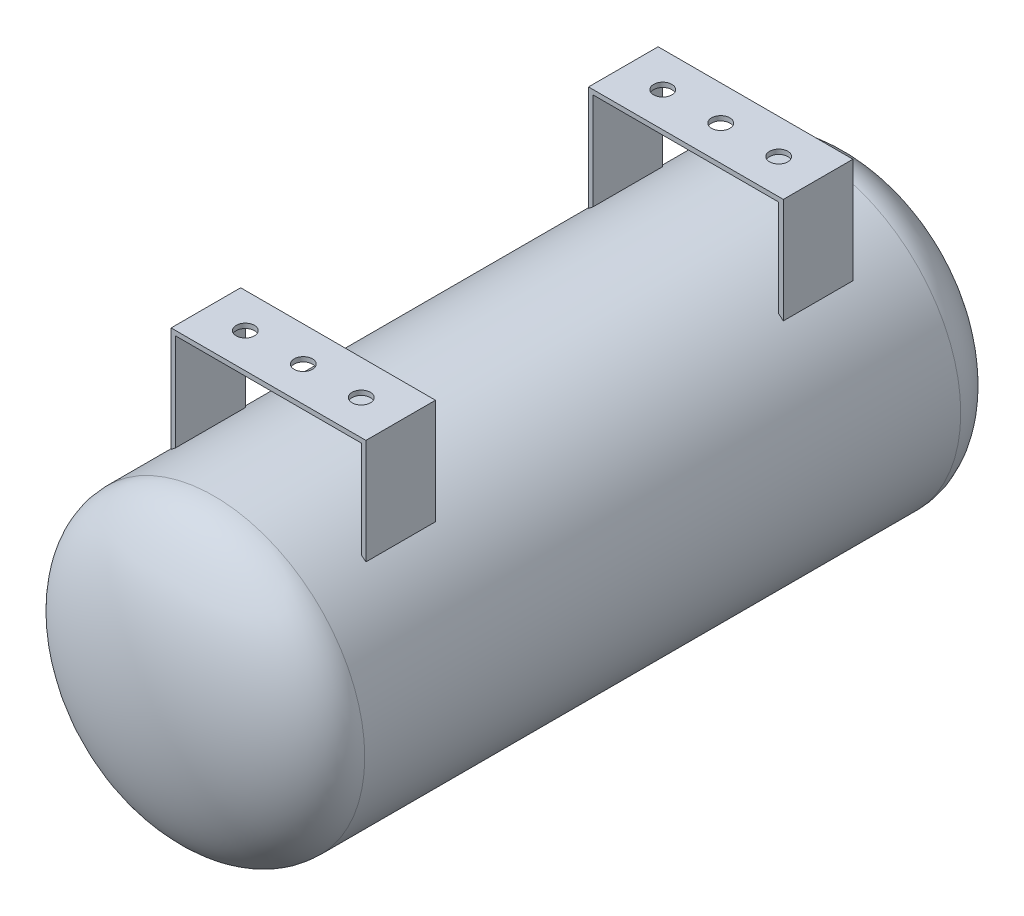
ISO-10303-21;
HEADER;
FILE_DESCRIPTION(('STEP AP214'),'2;1');
FILE_NAME('part.step','',(''),(''),'','','');
FILE_SCHEMA(('AUTOMOTIVE_DESIGN { 1 0 10303 214 1 1 1 1 }'));
ENDSEC;
DATA;
#1=APPLICATION_CONTEXT('core data for automotive mechanical design processes');
#2=APPLICATION_PROTOCOL_DEFINITION('international standard','automotive_design',2000,#1);
#3=PRODUCT_CONTEXT('',#1,'mechanical');
#4=PRODUCT('Part','Part','',(#3));
#5=PRODUCT_RELATED_PRODUCT_CATEGORY('part','',(#4));
#6=PRODUCT_DEFINITION_FORMATION('','',#4);
#7=PRODUCT_DEFINITION_CONTEXT('part definition',#1,'design');
#8=PRODUCT_DEFINITION('design','',#6,#7);
#9=PRODUCT_DEFINITION_SHAPE('','',#8);
#10=(LENGTH_UNIT() NAMED_UNIT(*) SI_UNIT(.MILLI.,.METRE.));
#11=(NAMED_UNIT(*) PLANE_ANGLE_UNIT() SI_UNIT($,.RADIAN.));
#12=(NAMED_UNIT(*) SI_UNIT($,.STERADIAN.) SOLID_ANGLE_UNIT());
#13=UNCERTAINTY_MEASURE_WITH_UNIT(LENGTH_MEASURE(1.E-05),#10,'distance_accuracy_value','');
#14=(GEOMETRIC_REPRESENTATION_CONTEXT(3) GLOBAL_UNCERTAINTY_ASSIGNED_CONTEXT((#13)) GLOBAL_UNIT_ASSIGNED_CONTEXT((#10,
#11,#12)) REPRESENTATION_CONTEXT('',''));
#15=CARTESIAN_POINT('',(0.,0.,0.));
#16=DIRECTION('',(0.,0.,1.));
#17=DIRECTION('',(1.,0.,0.));
#18=AXIS2_PLACEMENT_3D('',#15,#16,#17);
#19=CARTESIAN_POINT('',(50.8,-82.551,133.35));
#20=DIRECTION('',(-1.,0.,0.));
#21=DIRECTION('',(0.,0.,1.));
#22=AXIS2_PLACEMENT_3D('',#19,#20,#21);
#23=PLANE('',#22);
#24=DIRECTION('',(0.,1.,0.));
#25=VECTOR('',#24,1.);
#26=CARTESIAN_POINT('',(50.8,-82.551,133.35));
#27=LINE('',#26,#25);
#28=CARTESIAN_POINT('',(50.8,65.0681373638435,133.35));
#29=VERTEX_POINT('',#28);
#30=CARTESIAN_POINT('',(50.8,118.11,133.35));
#31=VERTEX_POINT('',#30);
#32=EDGE_CURVE('E221',#29,#31,#27,.T.);
#33=ORIENTED_EDGE('',*,*,#32,.T.);
#34=DIRECTION('',(0.,0.,-1.));
#35=VECTOR('',#34,1.);
#36=CARTESIAN_POINT('',(50.8,118.11,133.35));
#37=LINE('',#36,#35);
#38=CARTESIAN_POINT('',(50.8,118.11,95.25));
#39=VERTEX_POINT('',#38);
#40=EDGE_CURVE('E207',#31,#39,#37,.T.);
#41=ORIENTED_EDGE('',*,*,#40,.T.);
#42=DIRECTION('',(0.,1.,0.));
#43=VECTOR('',#42,1.);
#44=CARTESIAN_POINT('',(50.8,-82.551,95.25));
#45=LINE('',#44,#43);
#46=CARTESIAN_POINT('',(50.8,65.0681373638435,95.25));
#47=VERTEX_POINT('',#46);
#48=EDGE_CURVE('E225',#47,#39,#45,.T.);
#49=ORIENTED_EDGE('',*,*,#48,.F.);
#50=DIRECTION('',(0.,0.,1.));
#51=VECTOR('',#50,1.);
#52=CARTESIAN_POINT('',(50.8,65.0681373638435,0.));
#53=LINE('',#52,#51);
#54=EDGE_CURVE('E218',#47,#29,#53,.T.);
#55=ORIENTED_EDGE('',*,*,#54,.T.);
#56=EDGE_LOOP('',(#33,#41,#49,#55));
#57=FACE_BOUND('',#56,.T.);
#58=ADVANCED_FACE('F38',(#57),#23,.T.);
#59=CARTESIAN_POINT('',(-50.8,-82.551,-133.35));
#60=DIRECTION('',(1.,0.,0.));
#61=DIRECTION('',(0.,0.,-1.));
#62=AXIS2_PLACEMENT_3D('',#59,#60,#61);
#63=PLANE('',#62);
#64=DIRECTION('',(0.,1.,0.));
#65=VECTOR('',#64,1.);
#66=CARTESIAN_POINT('',(-50.8,-82.551,-133.35));
#67=LINE('',#66,#65);
#68=CARTESIAN_POINT('',(-50.8,65.0681373638435,-133.35));
#69=VERTEX_POINT('',#68);
#70=CARTESIAN_POINT('',(-50.8,118.11,-133.35));
#71=VERTEX_POINT('',#70);
#72=EDGE_CURVE('E313',#69,#71,#67,.T.);
#73=ORIENTED_EDGE('',*,*,#72,.T.);
#74=DIRECTION('',(0.,0.,1.));
#75=VECTOR('',#74,1.);
#76=CARTESIAN_POINT('',(-50.8,118.11,-133.35));
#77=LINE('',#76,#75);
#78=CARTESIAN_POINT('',(-50.8,118.11,-95.25));
#79=VERTEX_POINT('',#78);
#80=EDGE_CURVE('E288',#71,#79,#77,.T.);
#81=ORIENTED_EDGE('',*,*,#80,.T.);
#82=DIRECTION('',(0.,1.,0.));
#83=VECTOR('',#82,1.);
#84=CARTESIAN_POINT('',(-50.8,-82.551,-95.25));
#85=LINE('',#84,#83);
#86=CARTESIAN_POINT('',(-50.8,65.0681373638435,-95.25));
#87=VERTEX_POINT('',#86);
#88=EDGE_CURVE('E316',#87,#79,#85,.T.);
#89=ORIENTED_EDGE('',*,*,#88,.F.);
#90=DIRECTION('',(0.,0.,1.));
#91=VECTOR('',#90,1.);
#92=CARTESIAN_POINT('',(-50.8,65.0681373638435,0.));
#93=LINE('',#92,#91);
#94=EDGE_CURVE('E294',#87,#69,#93,.F.);
#95=ORIENTED_EDGE('',*,*,#94,.T.);
#96=EDGE_LOOP('',(#73,#81,#89,#95));
#97=FACE_BOUND('',#96,.T.);
#98=ADVANCED_FACE('F338',(#97),#63,.T.);
#99=CARTESIAN_POINT('',(0.,0.,163.195));
#100=DIRECTION('',(0.,1.,0.));
#101=DIRECTION('',(-1.,0.,0.));
#102=AXIS2_PLACEMENT_3D('',#99,#100,#101);
#103=ELLIPSE('',#102,82.55,40.64);
#104=TRIMMED_CURVE('',#103,(PARAMETER_VALUE(-1.5707963267949)),
(PARAMETER_VALUE(1.5707963267949)),.T.,.PARAMETER.);
#105=CARTESIAN_POINT('',(0.,0.,0.));
#106=DIRECTION('',(0.,0.,1.));
#107=AXIS1_PLACEMENT('',#105,#106);
#108=SURFACE_OF_REVOLUTION('',#104,#107);
#109=CARTESIAN_POINT('',(0.,0.,203.835));
#110=VERTEX_POINT('',#109);
#111=VERTEX_LOOP('',#110);
#112=FACE_BOUND('',#111,.T.);
#113=CARTESIAN_POINT('',(0.,0.,163.195));
#114=DIRECTION('',(0.,0.,1.));
#115=DIRECTION('',(1.,0.,0.));
#116=AXIS2_PLACEMENT_3D('',#113,#114,#115);
#117=CIRCLE('',#116,82.55);
#118=CARTESIAN_POINT('',(82.55,0.,163.195));
#119=VERTEX_POINT('',#118);
#120=EDGE_CURVE('E406',#119,#119,#117,.T.);
#121=ORIENTED_EDGE('',*,*,#120,.T.);
#122=EDGE_LOOP('',(#121));
#123=FACE_BOUND('',#122,.T.);
#124=ADVANCED_FACE('F40',(#112,#123),#108,.T.);
#125=CARTESIAN_POINT('',(0.,0.,0.));
#126=DIRECTION('',(0.,0.,1.));
#127=DIRECTION('',(1.,0.,0.));
#128=AXIS2_PLACEMENT_3D('',#125,#126,#127);
#129=CYLINDRICAL_SURFACE('',#128,82.55);
#130=DIRECTION('',(0.,0.,1.));
#131=VECTOR('',#130,1.);
#132=CARTESIAN_POINT('',(-50.8,65.0681373638435,0.));
#133=LINE('',#132,#131);
#134=CARTESIAN_POINT('',(-50.8,65.0681373638435,133.35));
#135=VERTEX_POINT('',#134);
#136=CARTESIAN_POINT('',(-50.8,65.0681373638435,95.25));
#137=VERTEX_POINT('',#136);
#138=EDGE_CURVE('E163',#135,#137,#133,.F.);
#139=ORIENTED_EDGE('',*,*,#138,.F.);
#140=CARTESIAN_POINT('',(0.,0.,133.35));
#141=DIRECTION('',(0.,0.,1.));
#142=DIRECTION('',(1.,0.,0.));
#143=AXIS2_PLACEMENT_3D('',#140,#141,#142);
#144=CIRCLE('',#143,82.55);
#145=CARTESIAN_POINT('',(-53.34,63.0027531144473,133.35));
#146=VERTEX_POINT('',#145);
#147=EDGE_CURVE('E178',#146,#135,#144,.F.);
#148=ORIENTED_EDGE('',*,*,#147,.F.);
#149=DIRECTION('',(0.,0.,1.));
#150=VECTOR('',#149,1.);
#151=CARTESIAN_POINT('',(-53.34,63.0027531144473,0.));
#152=LINE('',#151,#150);
#153=CARTESIAN_POINT('',(-53.34,63.0027531144473,95.25));
#154=VERTEX_POINT('',#153);
#155=EDGE_CURVE('E173',#154,#146,#152,.T.);
#156=ORIENTED_EDGE('',*,*,#155,.F.);
#157=CARTESIAN_POINT('',(0.,0.,95.25));
#158=DIRECTION('',(0.,0.,-1.));
#159=DIRECTION('',(-1.,0.,0.));
#160=AXIS2_PLACEMENT_3D('',#157,#158,#159);
#161=CIRCLE('',#160,82.55);
#162=EDGE_CURVE('E159',#137,#154,#161,.F.);
#163=ORIENTED_EDGE('',*,*,#162,.F.);
#164=EDGE_LOOP('',(#139,#148,#156,#163));
#165=FACE_BOUND('',#164,.T.);
#166=DIRECTION('',(0.,0.,1.));
#167=VECTOR('',#166,1.);
#168=CARTESIAN_POINT('',(53.34,63.0027531144473,0.));
#169=LINE('',#168,#167);
#170=CARTESIAN_POINT('',(53.34,63.0027531144473,133.35));
#171=VERTEX_POINT('',#170);
#172=CARTESIAN_POINT('',(53.34,63.0027531144473,95.25));
#173=VERTEX_POINT('',#172);
#174=EDGE_CURVE('E230',#171,#173,#169,.F.);
#175=ORIENTED_EDGE('',*,*,#174,.F.);
#176=CARTESIAN_POINT('',(0.,0.,133.35));
#177=DIRECTION('',(0.,0.,1.));
#178=DIRECTION('',(1.,0.,0.));
#179=AXIS2_PLACEMENT_3D('',#176,#177,#178);
#180=CIRCLE('',#179,82.55);
#181=EDGE_CURVE('E213',#29,#171,#180,.F.);
#182=ORIENTED_EDGE('',*,*,#181,.F.);
#183=ORIENTED_EDGE('',*,*,#54,.F.);
#184=CARTESIAN_POINT('',(0.,0.,95.25));
#185=DIRECTION('',(0.,0.,-1.));
#186=DIRECTION('',(-1.,0.,0.));
#187=AXIS2_PLACEMENT_3D('',#184,#185,#186);
#188=CIRCLE('',#187,82.55);
#189=EDGE_CURVE('E222',#173,#47,#188,.F.);
#190=ORIENTED_EDGE('',*,*,#189,.F.);
#191=EDGE_LOOP('',(#175,#182,#183,#190));
#192=FACE_BOUND('',#191,.T.);
#193=DIRECTION('',(0.,0.,1.));
#194=VECTOR('',#193,1.);
#195=CARTESIAN_POINT('',(50.8,65.0681373638435,0.));
#196=LINE('',#195,#194);
#197=CARTESIAN_POINT('',(50.8,65.0681373638435,-133.35));
#198=VERTEX_POINT('',#197);
#199=CARTESIAN_POINT('',(50.8,65.0681373638435,-95.25));
#200=VERTEX_POINT('',#199);
#201=EDGE_CURVE('E246',#198,#200,#196,.T.);
#202=ORIENTED_EDGE('',*,*,#201,.F.);
#203=CARTESIAN_POINT('',(0.,0.,-133.35));
#204=DIRECTION('',(0.,0.,-1.));
#205=DIRECTION('',(-1.,0.,0.));
#206=AXIS2_PLACEMENT_3D('',#203,#204,#205);
#207=CIRCLE('',#206,82.55);
#208=CARTESIAN_POINT('',(53.34,63.0027531144473,-133.35));
#209=VERTEX_POINT('',#208);
#210=EDGE_CURVE('E242',#209,#198,#207,.F.);
#211=ORIENTED_EDGE('',*,*,#210,.F.);
#212=DIRECTION('',(0.,0.,1.));
#213=VECTOR('',#212,1.);
#214=CARTESIAN_POINT('',(53.34,63.0027531144473,0.));
#215=LINE('',#214,#213);
#216=CARTESIAN_POINT('',(53.34,63.0027531144473,-95.25));
#217=VERTEX_POINT('',#216);
#218=EDGE_CURVE('E216',#217,#209,#215,.F.);
#219=ORIENTED_EDGE('',*,*,#218,.F.);
#220=CARTESIAN_POINT('',(0.,0.,-95.25));
#221=DIRECTION('',(0.,0.,1.));
#222=DIRECTION('',(1.,0.,0.));
#223=AXIS2_PLACEMENT_3D('',#220,#221,#222);
#224=CIRCLE('',#223,82.55);
#225=EDGE_CURVE('E254',#200,#217,#224,.F.);
#226=ORIENTED_EDGE('',*,*,#225,.F.);
#227=EDGE_LOOP('',(#202,#211,#219,#226));
#228=FACE_BOUND('',#227,.T.);
#229=ORIENTED_EDGE('',*,*,#94,.F.);
#230=CARTESIAN_POINT('',(0.,0.,-95.25));
#231=DIRECTION('',(0.,0.,1.));
#232=DIRECTION('',(1.,0.,0.));
#233=AXIS2_PLACEMENT_3D('',#230,#231,#232);
#234=CIRCLE('',#233,82.55);
#235=CARTESIAN_POINT('',(-53.34,63.0027531144473,-95.25));
#236=VERTEX_POINT('',#235);
#237=EDGE_CURVE('E298',#236,#87,#234,.F.);
#238=ORIENTED_EDGE('',*,*,#237,.F.);
#239=DIRECTION('',(0.,0.,1.));
#240=VECTOR('',#239,1.);
#241=CARTESIAN_POINT('',(-53.34,63.0027531144473,0.));
#242=LINE('',#241,#240);
#243=CARTESIAN_POINT('',(-53.34,63.0027531144473,-133.35));
#244=VERTEX_POINT('',#243);
#245=EDGE_CURVE('E300',#244,#236,#242,.T.);
#246=ORIENTED_EDGE('',*,*,#245,.F.);
#247=CARTESIAN_POINT('',(0.,0.,-133.35));
#248=DIRECTION('',(0.,0.,-1.));
#249=DIRECTION('',(-1.,0.,0.));
#250=AXIS2_PLACEMENT_3D('',#247,#248,#249);
#251=CIRCLE('',#250,82.55);
#252=EDGE_CURVE('E297',#69,#244,#251,.F.);
#253=ORIENTED_EDGE('',*,*,#252,.F.);
#254=EDGE_LOOP('',(#229,#238,#246,#253));
#255=FACE_BOUND('',#254,.T.);
#256=ORIENTED_EDGE('',*,*,#120,.F.);
#257=EDGE_LOOP('',(#256));
#258=FACE_BOUND('',#257,.T.);
#259=CARTESIAN_POINT('',(0.,0.,-163.195));
#260=DIRECTION('',(0.,0.,1.));
#261=DIRECTION('',(1.,0.,0.));
#262=AXIS2_PLACEMENT_3D('',#259,#260,#261);
#263=CIRCLE('',#262,82.55);
#264=CARTESIAN_POINT('',(82.55,0.,-163.195));
#265=VERTEX_POINT('',#264);
#266=EDGE_CURVE('E302',#265,#265,#263,.T.);
#267=ORIENTED_EDGE('',*,*,#266,.T.);
#268=EDGE_LOOP('',(#267));
#269=FACE_BOUND('',#268,.T.);
#270=ADVANCED_FACE('F170',(#165,#192,#228,#255,#258,#269),#129,.T.);
#271=CARTESIAN_POINT('',(0.,0.,-163.195));
#272=DIRECTION('',(0.,1.,0.));
#273=DIRECTION('',(-1.,0.,0.));
#274=AXIS2_PLACEMENT_3D('',#271,#272,#273);
#275=ELLIPSE('',#274,82.55,40.64);
#276=TRIMMED_CURVE('',#275,(PARAMETER_VALUE(4.71238898038469)),
(PARAMETER_VALUE(7.85398163397448)),.T.,.PARAMETER.);
#277=CARTESIAN_POINT('',(0.,0.,0.));
#278=DIRECTION('',(0.,0.,1.));
#279=AXIS1_PLACEMENT('',#277,#278);
#280=SURFACE_OF_REVOLUTION('',#276,#279);
#281=ORIENTED_EDGE('',*,*,#266,.F.);
#282=EDGE_LOOP('',(#281));
#283=FACE_BOUND('',#282,.T.);
#284=CARTESIAN_POINT('',(0.,0.,-203.835));
#285=VERTEX_POINT('',#284);
#286=VERTEX_LOOP('',#285);
#287=FACE_BOUND('',#286,.T.);
#288=ADVANCED_FACE('F327',(#283,#287),#280,.T.);
#289=CARTESIAN_POINT('',(0.,120.65,0.));
#290=DIRECTION('',(0.,1.,0.));
#291=DIRECTION('',(0.,0.,1.));
#292=AXIS2_PLACEMENT_3D('',#289,#290,#291);
#293=PLANE('',#292);
#294=DIRECTION('',(1.,0.,0.));
#295=VECTOR('',#294,1.);
#296=CARTESIAN_POINT('',(-53.34,120.65,-95.25));
#297=LINE('',#296,#295);
#298=CARTESIAN_POINT('',(-53.34,120.65,-95.25));
#299=VERTEX_POINT('',#298);
#300=CARTESIAN_POINT('',(53.34,120.65,-95.25));
#301=VERTEX_POINT('',#300);
#302=EDGE_CURVE('E305',#299,#301,#297,.T.);
#303=ORIENTED_EDGE('',*,*,#302,.T.);
#304=DIRECTION('',(0.,0.,-1.));
#305=VECTOR('',#304,1.);
#306=CARTESIAN_POINT('',(53.34,120.65,-133.35));
#307=LINE('',#306,#305);
#308=CARTESIAN_POINT('',(53.34,120.65,-133.35));
#309=VERTEX_POINT('',#308);
#310=EDGE_CURVE('E274',#301,#309,#307,.T.);
#311=ORIENTED_EDGE('',*,*,#310,.T.);
#312=DIRECTION('',(-1.,0.,0.));
#313=VECTOR('',#312,1.);
#314=CARTESIAN_POINT('',(-53.34,120.65,-133.35));
#315=LINE('',#314,#313);
#316=CARTESIAN_POINT('',(-53.34,120.65,-133.35));
#317=VERTEX_POINT('',#316);
#318=EDGE_CURVE('E307',#309,#317,#315,.T.);
#319=ORIENTED_EDGE('',*,*,#318,.T.);
#320=DIRECTION('',(0.,0.,1.));
#321=VECTOR('',#320,1.);
#322=CARTESIAN_POINT('',(-53.34,120.65,-133.35));
#323=LINE('',#322,#321);
#324=EDGE_CURVE('E293',#317,#299,#323,.T.);
#325=ORIENTED_EDGE('',*,*,#324,.T.);
#326=EDGE_LOOP('',(#303,#311,#319,#325));
#327=FACE_BOUND('',#326,.T.);
#328=CARTESIAN_POINT('',(31.75,120.65,-114.3));
#329=DIRECTION('',(0.,1.,0.));
#330=DIRECTION('',(0.,0.,1.));
#331=AXIS2_PLACEMENT_3D('',#328,#329,#330);
#332=CIRCLE('',#331,5.0000000000054);
#333=CARTESIAN_POINT('',(31.75,120.65,-109.299999999995));
#334=VERTEX_POINT('',#333);
#335=EDGE_CURVE('E250',#334,#334,#332,.T.);
#336=ORIENTED_EDGE('',*,*,#335,.F.);
#337=EDGE_LOOP('',(#336));
#338=FACE_BOUND('',#337,.T.);
#339=CARTESIAN_POINT('',(0.,120.65,-114.3));
#340=DIRECTION('',(0.,1.,0.));
#341=DIRECTION('',(0.,0.,1.));
#342=AXIS2_PLACEMENT_3D('',#339,#340,#341);
#343=CIRCLE('',#342,5.00000000000539);
#344=CARTESIAN_POINT('',(0.,120.65,-109.299999999995));
#345=VERTEX_POINT('',#344);
#346=EDGE_CURVE('E262',#345,#345,#343,.T.);
#347=ORIENTED_EDGE('',*,*,#346,.F.);
#348=EDGE_LOOP('',(#347));
#349=FACE_BOUND('',#348,.T.);
#350=CARTESIAN_POINT('',(-31.75,120.65,-114.3));
#351=DIRECTION('',(0.,1.,0.));
#352=DIRECTION('',(0.,0.,1.));
#353=AXIS2_PLACEMENT_3D('',#350,#351,#352);
#354=CIRCLE('',#353,5.);
#355=CARTESIAN_POINT('',(-31.75,120.65,-109.3));
#356=VERTEX_POINT('',#355);
#357=EDGE_CURVE('E268',#356,#356,#354,.T.);
#358=ORIENTED_EDGE('',*,*,#357,.F.);
#359=EDGE_LOOP('',(#358));
#360=FACE_BOUND('',#359,.T.);
#361=ADVANCED_FACE('F330',(#327,#338,#349,#360),#293,.T.);
#362=CARTESIAN_POINT('',(-53.34,-82.551,-95.25));
#363=DIRECTION('',(0.,0.,1.));
#364=DIRECTION('',(1.,0.,0.));
#365=AXIS2_PLACEMENT_3D('',#362,#363,#364);
#366=PLANE('',#365);
#367=DIRECTION('',(1.,0.,0.));
#368=VECTOR('',#367,1.);
#369=CARTESIAN_POINT('',(-53.34,118.11,-95.25));
#370=LINE('',#369,#368);
#371=CARTESIAN_POINT('',(50.8,118.11,-95.25));
#372=VERTEX_POINT('',#371);
#373=EDGE_CURVE('E277',#79,#372,#370,.T.);
#374=ORIENTED_EDGE('',*,*,#373,.T.);
#375=DIRECTION('',(0.,1.,0.));
#376=VECTOR('',#375,1.);
#377=CARTESIAN_POINT('',(50.8,-82.551,-95.25));
#378=LINE('',#377,#376);
#379=EDGE_CURVE('E245',#200,#372,#378,.T.);
#380=ORIENTED_EDGE('',*,*,#379,.F.);
#381=ORIENTED_EDGE('',*,*,#225,.T.);
#382=DIRECTION('',(0.,1.,0.));
#383=VECTOR('',#382,1.);
#384=CARTESIAN_POINT('',(53.34,118.11,-95.25));
#385=LINE('',#384,#383);
#386=EDGE_CURVE('E282',#217,#301,#385,.T.);
#387=ORIENTED_EDGE('',*,*,#386,.T.);
#388=ORIENTED_EDGE('',*,*,#302,.F.);
#389=DIRECTION('',(0.,1.,0.));
#390=VECTOR('',#389,1.);
#391=CARTESIAN_POINT('',(-53.34,-82.551,-95.25));
#392=LINE('',#391,#390);
#393=EDGE_CURVE('E309',#236,#299,#392,.T.);
#394=ORIENTED_EDGE('',*,*,#393,.F.);
#395=ORIENTED_EDGE('',*,*,#237,.T.);
#396=ORIENTED_EDGE('',*,*,#88,.T.);
#397=EDGE_LOOP('',(#374,#380,#381,#387,#388,#394,#395,#396));
#398=FACE_BOUND('',#397,.T.);
#399=ADVANCED_FACE('F387',(#398),#366,.T.);
#400=CARTESIAN_POINT('',(-53.34,-82.551,-133.35));
#401=DIRECTION('',(0.,0.,-1.));
#402=DIRECTION('',(-1.,0.,0.));
#403=AXIS2_PLACEMENT_3D('',#400,#401,#402);
#404=PLANE('',#403);
#405=DIRECTION('',(0.,1.,0.));
#406=VECTOR('',#405,1.);
#407=CARTESIAN_POINT('',(-53.34,-82.551,-133.35));
#408=LINE('',#407,#406);
#409=EDGE_CURVE('E310',#244,#317,#408,.T.);
#410=ORIENTED_EDGE('',*,*,#409,.T.);
#411=ORIENTED_EDGE('',*,*,#318,.F.);
#412=DIRECTION('',(0.,1.,0.));
#413=VECTOR('',#412,1.);
#414=CARTESIAN_POINT('',(53.34,118.11,-133.35));
#415=LINE('',#414,#413);
#416=EDGE_CURVE('E285',#209,#309,#415,.T.);
#417=ORIENTED_EDGE('',*,*,#416,.F.);
#418=ORIENTED_EDGE('',*,*,#210,.T.);
#419=DIRECTION('',(0.,1.,0.));
#420=VECTOR('',#419,1.);
#421=CARTESIAN_POINT('',(50.8,-82.551,-133.35));
#422=LINE('',#421,#420);
#423=CARTESIAN_POINT('',(50.8,118.11,-133.35));
#424=VERTEX_POINT('',#423);
#425=EDGE_CURVE('E247',#198,#424,#422,.T.);
#426=ORIENTED_EDGE('',*,*,#425,.T.);
#427=DIRECTION('',(-1.,0.,0.));
#428=VECTOR('',#427,1.);
#429=CARTESIAN_POINT('',(-53.34,118.11,-133.35));
#430=LINE('',#429,#428);
#431=EDGE_CURVE('E280',#424,#71,#430,.T.);
#432=ORIENTED_EDGE('',*,*,#431,.T.);
#433=ORIENTED_EDGE('',*,*,#72,.F.);
#434=ORIENTED_EDGE('',*,*,#252,.T.);
#435=EDGE_LOOP('',(#410,#411,#417,#418,#426,#432,#433,#434));
#436=FACE_BOUND('',#435,.T.);
#437=ADVANCED_FACE('F389',(#436),#404,.T.);
#438=CARTESIAN_POINT('',(-53.34,-82.551,-133.35));
#439=DIRECTION('',(-1.,0.,0.));
#440=DIRECTION('',(0.,0.,1.));
#441=AXIS2_PLACEMENT_3D('',#438,#439,#440);
#442=PLANE('',#441);
#443=ORIENTED_EDGE('',*,*,#324,.F.);
#444=ORIENTED_EDGE('',*,*,#409,.F.);
#445=ORIENTED_EDGE('',*,*,#245,.T.);
#446=ORIENTED_EDGE('',*,*,#393,.T.);
#447=EDGE_LOOP('',(#443,#444,#445,#446));
#448=FACE_BOUND('',#447,.T.);
#449=ADVANCED_FACE('F332',(#448),#442,.T.);
#450=CARTESIAN_POINT('',(53.34,118.11,-133.35));
#451=DIRECTION('',(1.,0.,0.));
#452=DIRECTION('',(0.,0.,-1.));
#453=AXIS2_PLACEMENT_3D('',#450,#451,#452);
#454=PLANE('',#453);
#455=ORIENTED_EDGE('',*,*,#310,.F.);
#456=ORIENTED_EDGE('',*,*,#386,.F.);
#457=ORIENTED_EDGE('',*,*,#218,.T.);
#458=ORIENTED_EDGE('',*,*,#416,.T.);
#459=EDGE_LOOP('',(#455,#456,#457,#458));
#460=FACE_BOUND('',#459,.T.);
#461=ADVANCED_FACE('F380',(#460),#454,.T.);
#462=CARTESIAN_POINT('',(0.,118.11,0.));
#463=DIRECTION('',(0.,1.,0.));
#464=DIRECTION('',(0.,0.,1.));
#465=AXIS2_PLACEMENT_3D('',#462,#463,#464);
#466=PLANE('',#465);
#467=ORIENTED_EDGE('',*,*,#431,.F.);
#468=DIRECTION('',(0.,0.,1.));
#469=VECTOR('',#468,1.);
#470=CARTESIAN_POINT('',(50.8,118.11,0.));
#471=LINE('',#470,#469);
#472=EDGE_CURVE('E47',#424,#372,#471,.T.);
#473=ORIENTED_EDGE('',*,*,#472,.T.);
#474=ORIENTED_EDGE('',*,*,#373,.F.);
#475=ORIENTED_EDGE('',*,*,#80,.F.);
#476=EDGE_LOOP('',(#467,#473,#474,#475));
#477=FACE_BOUND('',#476,.T.);
#478=CARTESIAN_POINT('',(31.75,118.11,-114.3));
#479=DIRECTION('',(0.,1.,0.));
#480=DIRECTION('',(0.,0.,1.));
#481=AXIS2_PLACEMENT_3D('',#478,#479,#480);
#482=CIRCLE('',#481,5.0000000000054);
#483=CARTESIAN_POINT('',(31.75,118.11,-109.299999999995));
#484=VERTEX_POINT('',#483);
#485=EDGE_CURVE('E259',#484,#484,#482,.T.);
#486=ORIENTED_EDGE('',*,*,#485,.T.);
#487=EDGE_LOOP('',(#486));
#488=FACE_BOUND('',#487,.T.);
#489=CARTESIAN_POINT('',(0.,118.11,-114.3));
#490=DIRECTION('',(0.,1.,0.));
#491=DIRECTION('',(0.,0.,1.));
#492=AXIS2_PLACEMENT_3D('',#489,#490,#491);
#493=CIRCLE('',#492,5.00000000000539);
#494=CARTESIAN_POINT('',(0.,118.11,-109.299999999995));
#495=VERTEX_POINT('',#494);
#496=EDGE_CURVE('E265',#495,#495,#493,.T.);
#497=ORIENTED_EDGE('',*,*,#496,.T.);
#498=EDGE_LOOP('',(#497));
#499=FACE_BOUND('',#498,.T.);
#500=CARTESIAN_POINT('',(-31.75,118.11,-114.3));
#501=DIRECTION('',(0.,1.,0.));
#502=DIRECTION('',(0.,0.,1.));
#503=AXIS2_PLACEMENT_3D('',#500,#501,#502);
#504=CIRCLE('',#503,5.);
#505=CARTESIAN_POINT('',(-31.75,118.11,-109.3));
#506=VERTEX_POINT('',#505);
#507=EDGE_CURVE('E271',#506,#506,#504,.T.);
#508=ORIENTED_EDGE('',*,*,#507,.T.);
#509=EDGE_LOOP('',(#508));
#510=FACE_BOUND('',#509,.T.);
#511=ADVANCED_FACE('F376',(#477,#488,#499,#510),#466,.F.);
#512=CARTESIAN_POINT('',(-31.75,118.11,-114.3));
#513=DIRECTION('',(0.,1.,0.));
#514=DIRECTION('',(0.,0.,1.));
#515=AXIS2_PLACEMENT_3D('',#512,#513,#514);
#516=CYLINDRICAL_SURFACE('',#515,5.);
#517=ORIENTED_EDGE('',*,*,#507,.F.);
#518=EDGE_LOOP('',(#517));
#519=FACE_BOUND('',#518,.T.);
#520=ORIENTED_EDGE('',*,*,#357,.T.);
#521=EDGE_LOOP('',(#520));
#522=FACE_BOUND('',#521,.T.);
#523=ADVANCED_FACE('F372',(#519,#522),#516,.F.);
#524=CARTESIAN_POINT('',(0.,118.11,-114.3));
#525=DIRECTION('',(0.,1.,0.));
#526=DIRECTION('',(0.,0.,1.));
#527=AXIS2_PLACEMENT_3D('',#524,#525,#526);
#528=CYLINDRICAL_SURFACE('',#527,5.00000000000539);
#529=ORIENTED_EDGE('',*,*,#496,.F.);
#530=EDGE_LOOP('',(#529));
#531=FACE_BOUND('',#530,.T.);
#532=ORIENTED_EDGE('',*,*,#346,.T.);
#533=EDGE_LOOP('',(#532));
#534=FACE_BOUND('',#533,.T.);
#535=ADVANCED_FACE('F368',(#531,#534),#528,.F.);
#536=CARTESIAN_POINT('',(31.75,118.11,-114.3));
#537=DIRECTION('',(0.,1.,0.));
#538=DIRECTION('',(0.,0.,1.));
#539=AXIS2_PLACEMENT_3D('',#536,#537,#538);
#540=CYLINDRICAL_SURFACE('',#539,5.0000000000054);
#541=ORIENTED_EDGE('',*,*,#485,.F.);
#542=EDGE_LOOP('',(#541));
#543=FACE_BOUND('',#542,.T.);
#544=ORIENTED_EDGE('',*,*,#335,.T.);
#545=EDGE_LOOP('',(#544));
#546=FACE_BOUND('',#545,.T.);
#547=ADVANCED_FACE('F364',(#543,#546),#540,.F.);
#548=CARTESIAN_POINT('',(50.8,-82.551,-133.35));
#549=DIRECTION('',(-1.,0.,0.));
#550=DIRECTION('',(0.,0.,1.));
#551=AXIS2_PLACEMENT_3D('',#548,#549,#550);
#552=PLANE('',#551);
#553=ORIENTED_EDGE('',*,*,#472,.F.);
#554=ORIENTED_EDGE('',*,*,#425,.F.);
#555=ORIENTED_EDGE('',*,*,#201,.T.);
#556=ORIENTED_EDGE('',*,*,#379,.T.);
#557=EDGE_LOOP('',(#553,#554,#555,#556));
#558=FACE_BOUND('',#557,.T.);
#559=ADVANCED_FACE('F354',(#558),#552,.T.);
#560=CARTESIAN_POINT('',(53.34,-82.551,133.35));
#561=DIRECTION('',(0.,0.,1.));
#562=DIRECTION('',(1.,0.,0.));
#563=AXIS2_PLACEMENT_3D('',#560,#561,#562);
#564=PLANE('',#563);
#565=DIRECTION('',(0.,1.,0.));
#566=VECTOR('',#565,1.);
#567=CARTESIAN_POINT('',(53.34,-82.551,133.35));
#568=LINE('',#567,#566);
#569=CARTESIAN_POINT('',(53.34,120.65,133.35));
#570=VERTEX_POINT('',#569);
#571=EDGE_CURVE('E217',#171,#570,#568,.T.);
#572=ORIENTED_EDGE('',*,*,#571,.T.);
#573=DIRECTION('',(1.,0.,0.));
#574=VECTOR('',#573,1.);
#575=CARTESIAN_POINT('',(53.34,120.65,133.35));
#576=LINE('',#575,#574);
#577=CARTESIAN_POINT('',(-53.34,120.65,133.35));
#578=VERTEX_POINT('',#577);
#579=EDGE_CURVE('E231',#578,#570,#576,.T.);
#580=ORIENTED_EDGE('',*,*,#579,.F.);
#581=DIRECTION('',(0.,1.,0.));
#582=VECTOR('',#581,1.);
#583=CARTESIAN_POINT('',(-53.34,118.11,133.35));
#584=LINE('',#583,#582);
#585=EDGE_CURVE('E182',#146,#578,#584,.T.);
#586=ORIENTED_EDGE('',*,*,#585,.F.);
#587=ORIENTED_EDGE('',*,*,#147,.T.);
#588=DIRECTION('',(0.,1.,0.));
#589=VECTOR('',#588,1.);
#590=CARTESIAN_POINT('',(-50.8,-82.551,133.35));
#591=LINE('',#590,#589);
#592=CARTESIAN_POINT('',(-50.8,118.11,133.35));
#593=VERTEX_POINT('',#592);
#594=EDGE_CURVE('E54',#135,#593,#591,.T.);
#595=ORIENTED_EDGE('',*,*,#594,.T.);
#596=DIRECTION('',(1.,0.,0.));
#597=VECTOR('',#596,1.);
#598=CARTESIAN_POINT('',(-53.34,118.11,133.35));
#599=LINE('',#598,#597);
#600=EDGE_CURVE('E189',#593,#31,#599,.T.);
#601=ORIENTED_EDGE('',*,*,#600,.T.);
#602=ORIENTED_EDGE('',*,*,#32,.F.);
#603=ORIENTED_EDGE('',*,*,#181,.T.);
#604=EDGE_LOOP('',(#572,#580,#586,#587,#595,#601,#602,#603));
#605=FACE_BOUND('',#604,.T.);
#606=ADVANCED_FACE('F351',(#605),#564,.T.);
#607=CARTESIAN_POINT('',(53.34,-82.551,95.25));
#608=DIRECTION('',(0.,0.,-1.));
#609=DIRECTION('',(-1.,0.,0.));
#610=AXIS2_PLACEMENT_3D('',#607,#608,#609);
#611=PLANE('',#610);
#612=DIRECTION('',(-1.,0.,0.));
#613=VECTOR('',#612,1.);
#614=CARTESIAN_POINT('',(-53.34,118.11,95.25));
#615=LINE('',#614,#613);
#616=CARTESIAN_POINT('',(-50.8,118.11,95.25));
#617=VERTEX_POINT('',#616);
#618=EDGE_CURVE('E162',#39,#617,#615,.T.);
#619=ORIENTED_EDGE('',*,*,#618,.T.);
#620=DIRECTION('',(0.,1.,0.));
#621=VECTOR('',#620,1.);
#622=CARTESIAN_POINT('',(-50.8,-82.551,95.25));
#623=LINE('',#622,#621);
#624=EDGE_CURVE('E59',#137,#617,#623,.T.);
#625=ORIENTED_EDGE('',*,*,#624,.F.);
#626=ORIENTED_EDGE('',*,*,#162,.T.);
#627=DIRECTION('',(0.,1.,0.));
#628=VECTOR('',#627,1.);
#629=CARTESIAN_POINT('',(-53.34,118.11,95.25));
#630=LINE('',#629,#628);
#631=CARTESIAN_POINT('',(-53.34,120.65,95.25));
#632=VERTEX_POINT('',#631);
#633=EDGE_CURVE('E180',#154,#632,#630,.T.);
#634=ORIENTED_EDGE('',*,*,#633,.T.);
#635=DIRECTION('',(-1.,0.,0.));
#636=VECTOR('',#635,1.);
#637=CARTESIAN_POINT('',(53.34,120.65,95.25));
#638=LINE('',#637,#636);
#639=CARTESIAN_POINT('',(53.34,120.65,95.25));
#640=VERTEX_POINT('',#639);
#641=EDGE_CURVE('E212',#640,#632,#638,.T.);
#642=ORIENTED_EDGE('',*,*,#641,.F.);
#643=DIRECTION('',(0.,1.,0.));
#644=VECTOR('',#643,1.);
#645=CARTESIAN_POINT('',(53.34,-82.551,95.25));
#646=LINE('',#645,#644);
#647=EDGE_CURVE('E228',#173,#640,#646,.T.);
#648=ORIENTED_EDGE('',*,*,#647,.F.);
#649=ORIENTED_EDGE('',*,*,#189,.T.);
#650=ORIENTED_EDGE('',*,*,#48,.T.);
#651=EDGE_LOOP('',(#619,#625,#626,#634,#642,#648,#649,#650));
#652=FACE_BOUND('',#651,.T.);
#653=ADVANCED_FACE('F156',(#652),#611,.T.);
#654=CARTESIAN_POINT('',(53.34,-82.551,133.35));
#655=DIRECTION('',(1.,0.,0.));
#656=DIRECTION('',(0.,0.,-1.));
#657=AXIS2_PLACEMENT_3D('',#654,#655,#656);
#658=PLANE('',#657);
#659=DIRECTION('',(0.,0.,-1.));
#660=VECTOR('',#659,1.);
#661=CARTESIAN_POINT('',(53.34,120.65,133.35));
#662=LINE('',#661,#660);
#663=EDGE_CURVE('E236',#570,#640,#662,.T.);
#664=ORIENTED_EDGE('',*,*,#663,.F.);
#665=ORIENTED_EDGE('',*,*,#571,.F.);
#666=ORIENTED_EDGE('',*,*,#174,.T.);
#667=ORIENTED_EDGE('',*,*,#647,.T.);
#668=EDGE_LOOP('',(#664,#665,#666,#667));
#669=FACE_BOUND('',#668,.T.);
#670=ADVANCED_FACE('F360',(#669),#658,.T.);
#671=CARTESIAN_POINT('',(0.,120.65,0.));
#672=DIRECTION('',(0.,-1.,0.));
#673=DIRECTION('',(0.,0.,-1.));
#674=AXIS2_PLACEMENT_3D('',#671,#672,#673);
#675=PLANE('',#674);
#676=ORIENTED_EDGE('',*,*,#641,.T.);
#677=DIRECTION('',(0.,0.,1.));
#678=VECTOR('',#677,1.);
#679=CARTESIAN_POINT('',(-53.34,120.65,133.35));
#680=LINE('',#679,#678);
#681=EDGE_CURVE('E185',#632,#578,#680,.T.);
#682=ORIENTED_EDGE('',*,*,#681,.T.);
#683=ORIENTED_EDGE('',*,*,#579,.T.);
#684=ORIENTED_EDGE('',*,*,#663,.T.);
#685=EDGE_LOOP('',(#676,#682,#683,#684));
#686=FACE_BOUND('',#685,.T.);
#687=CARTESIAN_POINT('',(-31.75,120.65,114.3));
#688=DIRECTION('',(0.,1.,0.));
#689=DIRECTION('',(0.,0.,-1.));
#690=AXIS2_PLACEMENT_3D('',#687,#688,#689);
#691=CIRCLE('',#690,5.);
#692=CARTESIAN_POINT('',(-31.75,120.65,109.3));
#693=VERTEX_POINT('',#692);
#694=EDGE_CURVE('E204',#693,#693,#691,.T.);
#695=ORIENTED_EDGE('',*,*,#694,.F.);
#696=EDGE_LOOP('',(#695));
#697=FACE_BOUND('',#696,.T.);
#698=CARTESIAN_POINT('',(0.,120.65,114.3));
#699=DIRECTION('',(0.,1.,0.));
#700=DIRECTION('',(0.,0.,-1.));
#701=AXIS2_PLACEMENT_3D('',#698,#699,#700);
#702=CIRCLE('',#701,5.00000000000539);
#703=CARTESIAN_POINT('',(0.,120.65,109.299999999995));
#704=VERTEX_POINT('',#703);
#705=EDGE_CURVE('E198',#704,#704,#702,.T.);
#706=ORIENTED_EDGE('',*,*,#705,.F.);
#707=EDGE_LOOP('',(#706));
#708=FACE_BOUND('',#707,.T.);
#709=CARTESIAN_POINT('',(31.75,120.65,114.3));
#710=DIRECTION('',(0.,1.,0.));
#711=DIRECTION('',(0.,0.,-1.));
#712=AXIS2_PLACEMENT_3D('',#709,#710,#711);
#713=CIRCLE('',#712,5.0000000000054);
#714=CARTESIAN_POINT('',(31.75,120.65,109.299999999995));
#715=VERTEX_POINT('',#714);
#716=EDGE_CURVE('E192',#715,#715,#713,.T.);
#717=ORIENTED_EDGE('',*,*,#716,.F.);
#718=EDGE_LOOP('',(#717));
#719=FACE_BOUND('',#718,.T.);
#720=ADVANCED_FACE('F356',(#686,#697,#708,#719),#675,.F.);
#721=CARTESIAN_POINT('',(-53.34,118.11,133.35));
#722=DIRECTION('',(-1.,0.,0.));
#723=DIRECTION('',(0.,0.,1.));
#724=AXIS2_PLACEMENT_3D('',#721,#722,#723);
#725=PLANE('',#724);
#726=ORIENTED_EDGE('',*,*,#681,.F.);
#727=ORIENTED_EDGE('',*,*,#633,.F.);
#728=ORIENTED_EDGE('',*,*,#155,.T.);
#729=ORIENTED_EDGE('',*,*,#585,.T.);
#730=EDGE_LOOP('',(#726,#727,#728,#729));
#731=FACE_BOUND('',#730,.T.);
#732=ADVANCED_FACE('F359',(#731),#725,.T.);
#733=CARTESIAN_POINT('',(0.,118.11,0.));
#734=DIRECTION('',(0.,1.,0.));
#735=DIRECTION('',(0.,0.,1.));
#736=AXIS2_PLACEMENT_3D('',#733,#734,#735);
#737=PLANE('',#736);
#738=ORIENTED_EDGE('',*,*,#600,.F.);
#739=DIRECTION('',(0.,0.,-1.));
#740=VECTOR('',#739,1.);
#741=CARTESIAN_POINT('',(-50.8,118.11,0.));
#742=LINE('',#741,#740);
#743=EDGE_CURVE('E11',#593,#617,#742,.T.);
#744=ORIENTED_EDGE('',*,*,#743,.T.);
#745=ORIENTED_EDGE('',*,*,#618,.F.);
#746=ORIENTED_EDGE('',*,*,#40,.F.);
#747=EDGE_LOOP('',(#738,#744,#745,#746));
#748=FACE_BOUND('',#747,.T.);
#749=CARTESIAN_POINT('',(-31.75,118.11,114.3));
#750=DIRECTION('',(0.,1.,0.));
#751=DIRECTION('',(0.,0.,-1.));
#752=AXIS2_PLACEMENT_3D('',#749,#750,#751);
#753=CIRCLE('',#752,5.);
#754=CARTESIAN_POINT('',(-31.75,118.11,109.3));
#755=VERTEX_POINT('',#754);
#756=EDGE_CURVE('E201',#755,#755,#753,.T.);
#757=ORIENTED_EDGE('',*,*,#756,.T.);
#758=EDGE_LOOP('',(#757));
#759=FACE_BOUND('',#758,.T.);
#760=CARTESIAN_POINT('',(0.,118.11,114.3));
#761=DIRECTION('',(0.,1.,0.));
#762=DIRECTION('',(0.,0.,-1.));
#763=AXIS2_PLACEMENT_3D('',#760,#761,#762);
#764=CIRCLE('',#763,5.00000000000539);
#765=CARTESIAN_POINT('',(0.,118.11,109.299999999995));
#766=VERTEX_POINT('',#765);
#767=EDGE_CURVE('E195',#766,#766,#764,.T.);
#768=ORIENTED_EDGE('',*,*,#767,.T.);
#769=EDGE_LOOP('',(#768));
#770=FACE_BOUND('',#769,.T.);
#771=CARTESIAN_POINT('',(31.75,118.11,114.3));
#772=DIRECTION('',(0.,1.,0.));
#773=DIRECTION('',(0.,0.,-1.));
#774=AXIS2_PLACEMENT_3D('',#771,#772,#773);
#775=CIRCLE('',#774,5.0000000000054);
#776=CARTESIAN_POINT('',(31.75,118.11,109.299999999995));
#777=VERTEX_POINT('',#776);
#778=EDGE_CURVE('E188',#777,#777,#775,.T.);
#779=ORIENTED_EDGE('',*,*,#778,.T.);
#780=EDGE_LOOP('',(#779));
#781=FACE_BOUND('',#780,.T.);
#782=ADVANCED_FACE('F480',(#748,#759,#770,#781),#737,.F.);
#783=CARTESIAN_POINT('',(31.75,118.11,114.3));
#784=DIRECTION('',(0.,1.,0.));
#785=DIRECTION('',(0.,0.,1.));
#786=AXIS2_PLACEMENT_3D('',#783,#784,#785);
#787=CYLINDRICAL_SURFACE('',#786,5.0000000000054);
#788=ORIENTED_EDGE('',*,*,#778,.F.);
#789=EDGE_LOOP('',(#788));
#790=FACE_BOUND('',#789,.T.);
#791=ORIENTED_EDGE('',*,*,#716,.T.);
#792=EDGE_LOOP('',(#791));
#793=FACE_BOUND('',#792,.T.);
#794=ADVANCED_FACE('F488',(#790,#793),#787,.F.);
#795=CARTESIAN_POINT('',(0.,118.11,114.3));
#796=DIRECTION('',(0.,1.,0.));
#797=DIRECTION('',(0.,0.,1.));
#798=AXIS2_PLACEMENT_3D('',#795,#796,#797);
#799=CYLINDRICAL_SURFACE('',#798,5.00000000000539);
#800=ORIENTED_EDGE('',*,*,#767,.F.);
#801=EDGE_LOOP('',(#800));
#802=FACE_BOUND('',#801,.T.);
#803=ORIENTED_EDGE('',*,*,#705,.T.);
#804=EDGE_LOOP('',(#803));
#805=FACE_BOUND('',#804,.T.);
#806=ADVANCED_FACE('F496',(#802,#805),#799,.F.);
#807=CARTESIAN_POINT('',(-31.75,118.11,114.3));
#808=DIRECTION('',(0.,1.,0.));
#809=DIRECTION('',(0.,0.,1.));
#810=AXIS2_PLACEMENT_3D('',#807,#808,#809);
#811=CYLINDRICAL_SURFACE('',#810,5.);
#812=ORIENTED_EDGE('',*,*,#756,.F.);
#813=EDGE_LOOP('',(#812));
#814=FACE_BOUND('',#813,.T.);
#815=ORIENTED_EDGE('',*,*,#694,.T.);
#816=EDGE_LOOP('',(#815));
#817=FACE_BOUND('',#816,.T.);
#818=ADVANCED_FACE('F504',(#814,#817),#811,.F.);
#819=CARTESIAN_POINT('',(-50.8,-82.551,133.35));
#820=DIRECTION('',(1.,0.,0.));
#821=DIRECTION('',(0.,0.,-1.));
#822=AXIS2_PLACEMENT_3D('',#819,#820,#821);
#823=PLANE('',#822);
#824=ORIENTED_EDGE('',*,*,#743,.F.);
#825=ORIENTED_EDGE('',*,*,#594,.F.);
#826=ORIENTED_EDGE('',*,*,#138,.T.);
#827=ORIENTED_EDGE('',*,*,#624,.T.);
#828=EDGE_LOOP('',(#824,#825,#826,#827));
#829=FACE_BOUND('',#828,.T.);
#830=ADVANCED_FACE('F166',(#829),#823,.T.);
#831=CLOSED_SHELL('',(#58,#98,#124,#270,#288,#361,#399,#437,#449,#461,#511,#523,#535,#547,#559,
#606,#653,#670,#720,#732,#782,#794,#806,#818,#830));
#832=MANIFOLD_SOLID_BREP('B2',#831);
#833=ADVANCED_BREP_SHAPE_REPRESENTATION('',(#18,#832),#14);
#834=SHAPE_DEFINITION_REPRESENTATION(#9,#833);
ENDSEC;
END-ISO-10303-21;
